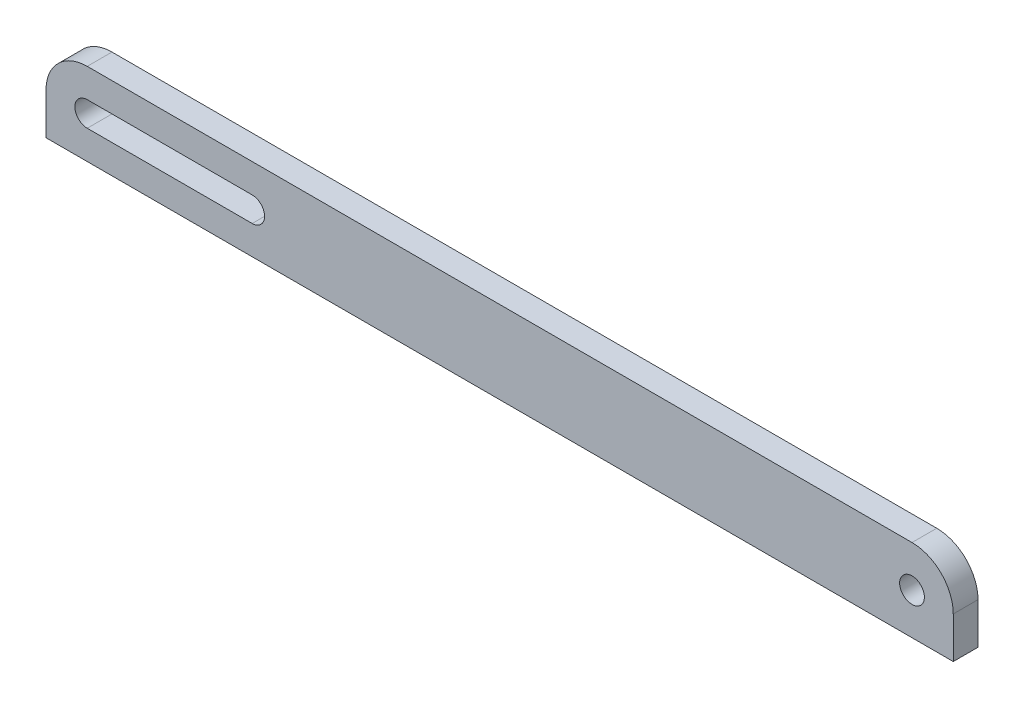
ISO-10303-21;
HEADER;
FILE_DESCRIPTION(('STEP AP214'),'2;1');
FILE_NAME('part.step','',(''),(''),'','','');
FILE_SCHEMA(('AUTOMOTIVE_DESIGN { 1 0 10303 214 1 1 1 1 }'));
ENDSEC;
DATA;
#1=APPLICATION_CONTEXT('core data for automotive mechanical design processes');
#2=APPLICATION_PROTOCOL_DEFINITION('international standard','automotive_design',2000,#1);
#3=PRODUCT_CONTEXT('',#1,'mechanical');
#4=PRODUCT('Part','Part','',(#3));
#5=PRODUCT_RELATED_PRODUCT_CATEGORY('part','',(#4));
#6=PRODUCT_DEFINITION_FORMATION('','',#4);
#7=PRODUCT_DEFINITION_CONTEXT('part definition',#1,'design');
#8=PRODUCT_DEFINITION('design','',#6,#7);
#9=PRODUCT_DEFINITION_SHAPE('','',#8);
#10=(LENGTH_UNIT() NAMED_UNIT(*) SI_UNIT(.MILLI.,.METRE.));
#11=(NAMED_UNIT(*) PLANE_ANGLE_UNIT() SI_UNIT($,.RADIAN.));
#12=(NAMED_UNIT(*) SI_UNIT($,.STERADIAN.) SOLID_ANGLE_UNIT());
#13=UNCERTAINTY_MEASURE_WITH_UNIT(LENGTH_MEASURE(1.E-05),#10,'distance_accuracy_value','');
#14=(GEOMETRIC_REPRESENTATION_CONTEXT(3) GLOBAL_UNCERTAINTY_ASSIGNED_CONTEXT((#13)) GLOBAL_UNIT_ASSIGNED_CONTEXT((#10,
#11,#12)) REPRESENTATION_CONTEXT('',''));
#15=CARTESIAN_POINT('',(0.,0.,0.));
#16=DIRECTION('',(0.,0.,1.));
#17=DIRECTION('',(1.,0.,0.));
#18=AXIS2_PLACEMENT_3D('',#15,#16,#17);
#19=CARTESIAN_POINT('',(-50.,0.,3.));
#20=DIRECTION('',(0.,0.,1.));
#21=DIRECTION('',(1.,0.,0.));
#22=AXIS2_PLACEMENT_3D('',#19,#20,#21);
#23=PLANE('',#22);
#24=CARTESIAN_POINT('',(-50.,0.,3.));
#25=DIRECTION('',(0.,0.,1.));
#26=DIRECTION('',(1.,0.,0.));
#27=AXIS2_PLACEMENT_3D('',#24,#25,#26);
#28=CIRCLE('',#27,5.);
#29=CARTESIAN_POINT('',(-50.,5.,3.));
#30=VERTEX_POINT('',#29);
#31=CARTESIAN_POINT('',(-55.,0.,3.));
#32=VERTEX_POINT('',#31);
#33=EDGE_CURVE('E156',#30,#32,#28,.T.);
#34=ORIENTED_EDGE('',*,*,#33,.T.);
#35=DIRECTION('',(0.,-1.,0.));
#36=VECTOR('',#35,1.);
#37=CARTESIAN_POINT('',(-55.,0.,3.));
#38=LINE('',#37,#36);
#39=CARTESIAN_POINT('',(-55.,-5.,3.));
#40=VERTEX_POINT('',#39);
#41=EDGE_CURVE('E159',#32,#40,#38,.T.);
#42=ORIENTED_EDGE('',*,*,#41,.T.);
#43=DIRECTION('',(1.,0.,0.));
#44=VECTOR('',#43,1.);
#45=CARTESIAN_POINT('',(-55.,-5.,3.));
#46=LINE('',#45,#44);
#47=CARTESIAN_POINT('',(55.,-4.99999999999999,3.));
#48=VERTEX_POINT('',#47);
#49=EDGE_CURVE('E162',#40,#48,#46,.T.);
#50=ORIENTED_EDGE('',*,*,#49,.T.);
#51=DIRECTION('',(0.,1.,0.));
#52=VECTOR('',#51,1.);
#53=CARTESIAN_POINT('',(55.,0.,3.));
#54=LINE('',#53,#52);
#55=CARTESIAN_POINT('',(55.,0.,3.));
#56=VERTEX_POINT('',#55);
#57=EDGE_CURVE('E164',#48,#56,#54,.T.);
#58=ORIENTED_EDGE('',*,*,#57,.T.);
#59=CARTESIAN_POINT('',(50.,0.,3.));
#60=DIRECTION('',(0.,0.,1.));
#61=DIRECTION('',(-1.,0.,0.));
#62=AXIS2_PLACEMENT_3D('',#59,#60,#61);
#63=CIRCLE('',#62,5.);
#64=CARTESIAN_POINT('',(50.,4.99999999999999,3.));
#65=VERTEX_POINT('',#64);
#66=EDGE_CURVE('E166',#56,#65,#63,.T.);
#67=ORIENTED_EDGE('',*,*,#66,.T.);
#68=DIRECTION('',(-1.,0.,0.));
#69=VECTOR('',#68,1.);
#70=CARTESIAN_POINT('',(50.,4.99999999999999,3.));
#71=LINE('',#70,#69);
#72=EDGE_CURVE('E168',#65,#30,#71,.T.);
#73=ORIENTED_EDGE('',*,*,#72,.T.);
#74=EDGE_LOOP('',(#34,#42,#50,#58,#67,#73));
#75=FACE_BOUND('',#74,.T.);
#76=CARTESIAN_POINT('',(50.,0.,3.));
#77=DIRECTION('',(0.,0.,1.));
#78=DIRECTION('',(-1.,0.,0.));
#79=AXIS2_PLACEMENT_3D('',#76,#77,#78);
#80=CIRCLE('',#79,1.5);
#81=CARTESIAN_POINT('',(48.5,0.,3.));
#82=VERTEX_POINT('',#81);
#83=EDGE_CURVE('E150',#82,#82,#80,.T.);
#84=ORIENTED_EDGE('',*,*,#83,.F.);
#85=EDGE_LOOP('',(#84));
#86=FACE_BOUND('',#85,.T.);
#87=DIRECTION('',(1.,0.,0.));
#88=VECTOR('',#87,1.);
#89=CARTESIAN_POINT('',(-50.,-1.5,3.));
#90=LINE('',#89,#88);
#91=CARTESIAN_POINT('',(-50.,-1.5,3.));
#92=VERTEX_POINT('',#91);
#93=CARTESIAN_POINT('',(-30.,-1.5,3.));
#94=VERTEX_POINT('',#93);
#95=EDGE_CURVE('E122',#92,#94,#90,.T.);
#96=ORIENTED_EDGE('',*,*,#95,.F.);
#97=CARTESIAN_POINT('',(-50.,0.,3.));
#98=DIRECTION('',(0.,0.,1.));
#99=DIRECTION('',(1.,0.,0.));
#100=AXIS2_PLACEMENT_3D('',#97,#98,#99);
#101=CIRCLE('',#100,1.5);
#102=CARTESIAN_POINT('',(-50.,1.5,3.));
#103=VERTEX_POINT('',#102);
#104=EDGE_CURVE('E114',#103,#92,#101,.T.);
#105=ORIENTED_EDGE('',*,*,#104,.F.);
#106=DIRECTION('',(-1.,0.,0.));
#107=VECTOR('',#106,1.);
#108=CARTESIAN_POINT('',(-50.,1.5,3.));
#109=LINE('',#108,#107);
#110=CARTESIAN_POINT('',(-30.,1.5,3.));
#111=VERTEX_POINT('',#110);
#112=EDGE_CURVE('E136',#111,#103,#109,.T.);
#113=ORIENTED_EDGE('',*,*,#112,.F.);
#114=CARTESIAN_POINT('',(-30.,0.,3.));
#115=DIRECTION('',(0.,0.,1.));
#116=DIRECTION('',(1.,0.,0.));
#117=AXIS2_PLACEMENT_3D('',#114,#115,#116);
#118=CIRCLE('',#117,1.5);
#119=EDGE_CURVE('E134',#94,#111,#118,.T.);
#120=ORIENTED_EDGE('',*,*,#119,.F.);
#121=EDGE_LOOP('',(#96,#105,#113,#120));
#122=FACE_BOUND('',#121,.T.);
#123=ADVANCED_FACE('F37',(#75,#86,#122),#23,.T.);
#124=CARTESIAN_POINT('',(-50.,0.,0.));
#125=DIRECTION('',(0.,0.,1.));
#126=DIRECTION('',(1.,0.,0.));
#127=AXIS2_PLACEMENT_3D('',#124,#125,#126);
#128=PLANE('',#127);
#129=CARTESIAN_POINT('',(50.,0.,0.));
#130=DIRECTION('',(0.,0.,1.));
#131=DIRECTION('',(-1.,0.,0.));
#132=AXIS2_PLACEMENT_3D('',#129,#130,#131);
#133=CIRCLE('',#132,1.5);
#134=CARTESIAN_POINT('',(48.5,0.,0.));
#135=VERTEX_POINT('',#134);
#136=EDGE_CURVE('E130',#135,#135,#133,.T.);
#137=ORIENTED_EDGE('',*,*,#136,.T.);
#138=EDGE_LOOP('',(#137));
#139=FACE_BOUND('',#138,.T.);
#140=CARTESIAN_POINT('',(-50.,0.,0.));
#141=DIRECTION('',(0.,0.,1.));
#142=DIRECTION('',(1.,0.,0.));
#143=AXIS2_PLACEMENT_3D('',#140,#141,#142);
#144=CIRCLE('',#143,5.);
#145=CARTESIAN_POINT('',(-50.,5.,0.));
#146=VERTEX_POINT('',#145);
#147=CARTESIAN_POINT('',(-55.,0.,0.));
#148=VERTEX_POINT('',#147);
#149=EDGE_CURVE('E153',#146,#148,#144,.T.);
#150=ORIENTED_EDGE('',*,*,#149,.F.);
#151=DIRECTION('',(-1.,0.,0.));
#152=VECTOR('',#151,1.);
#153=CARTESIAN_POINT('',(50.,4.99999999999999,0.));
#154=LINE('',#153,#152);
#155=CARTESIAN_POINT('',(50.,4.99999999999999,0.));
#156=VERTEX_POINT('',#155);
#157=EDGE_CURVE('E160',#156,#146,#154,.T.);
#158=ORIENTED_EDGE('',*,*,#157,.F.);
#159=CARTESIAN_POINT('',(50.,0.,0.));
#160=DIRECTION('',(0.,0.,1.));
#161=DIRECTION('',(-1.,0.,0.));
#162=AXIS2_PLACEMENT_3D('',#159,#160,#161);
#163=CIRCLE('',#162,5.);
#164=CARTESIAN_POINT('',(55.,0.,0.));
#165=VERTEX_POINT('',#164);
#166=EDGE_CURVE('E180',#165,#156,#163,.T.);
#167=ORIENTED_EDGE('',*,*,#166,.F.);
#168=DIRECTION('',(0.,1.,0.));
#169=VECTOR('',#168,1.);
#170=CARTESIAN_POINT('',(55.,0.,0.));
#171=LINE('',#170,#169);
#172=CARTESIAN_POINT('',(55.,-4.99999999999999,0.));
#173=VERTEX_POINT('',#172);
#174=EDGE_CURVE('E178',#173,#165,#171,.T.);
#175=ORIENTED_EDGE('',*,*,#174,.F.);
#176=DIRECTION('',(1.,0.,0.));
#177=VECTOR('',#176,1.);
#178=CARTESIAN_POINT('',(55.,-4.99999999999999,0.));
#179=LINE('',#178,#177);
#180=CARTESIAN_POINT('',(-55.,-5.,0.));
#181=VERTEX_POINT('',#180);
#182=EDGE_CURVE('E176',#181,#173,#179,.T.);
#183=ORIENTED_EDGE('',*,*,#182,.F.);
#184=DIRECTION('',(0.,-1.,0.));
#185=VECTOR('',#184,1.);
#186=CARTESIAN_POINT('',(-55.,0.,0.));
#187=LINE('',#186,#185);
#188=EDGE_CURVE('E173',#148,#181,#187,.T.);
#189=ORIENTED_EDGE('',*,*,#188,.F.);
#190=EDGE_LOOP('',(#150,#158,#167,#175,#183,#189));
#191=FACE_BOUND('',#190,.T.);
#192=CARTESIAN_POINT('',(-50.,0.,0.));
#193=DIRECTION('',(0.,0.,1.));
#194=DIRECTION('',(1.,0.,0.));
#195=AXIS2_PLACEMENT_3D('',#192,#193,#194);
#196=CIRCLE('',#195,1.5);
#197=CARTESIAN_POINT('',(-50.,1.5,0.));
#198=VERTEX_POINT('',#197);
#199=CARTESIAN_POINT('',(-50.,-1.5,0.));
#200=VERTEX_POINT('',#199);
#201=EDGE_CURVE('E60',#198,#200,#196,.T.);
#202=ORIENTED_EDGE('',*,*,#201,.T.);
#203=DIRECTION('',(1.,0.,0.));
#204=VECTOR('',#203,1.);
#205=CARTESIAN_POINT('',(-50.,-1.5,0.));
#206=LINE('',#205,#204);
#207=CARTESIAN_POINT('',(-30.,-1.5,0.));
#208=VERTEX_POINT('',#207);
#209=EDGE_CURVE('E129',#200,#208,#206,.T.);
#210=ORIENTED_EDGE('',*,*,#209,.T.);
#211=CARTESIAN_POINT('',(-30.,0.,0.));
#212=DIRECTION('',(0.,0.,1.));
#213=DIRECTION('',(1.,0.,0.));
#214=AXIS2_PLACEMENT_3D('',#211,#212,#213);
#215=CIRCLE('',#214,1.5);
#216=CARTESIAN_POINT('',(-30.,1.5,0.));
#217=VERTEX_POINT('',#216);
#218=EDGE_CURVE('E142',#208,#217,#215,.T.);
#219=ORIENTED_EDGE('',*,*,#218,.T.);
#220=DIRECTION('',(-1.,0.,0.));
#221=VECTOR('',#220,1.);
#222=CARTESIAN_POINT('',(-50.,1.5,0.));
#223=LINE('',#222,#221);
#224=EDGE_CURVE('E123',#217,#198,#223,.T.);
#225=ORIENTED_EDGE('',*,*,#224,.T.);
#226=EDGE_LOOP('',(#202,#210,#219,#225));
#227=FACE_BOUND('',#226,.T.);
#228=ADVANCED_FACE('F204',(#139,#191,#227),#128,.F.);
#229=CARTESIAN_POINT('',(-50.,0.,3.));
#230=DIRECTION('',(0.,0.,-1.));
#231=DIRECTION('',(-1.,0.,0.));
#232=AXIS2_PLACEMENT_3D('',#229,#230,#231);
#233=CYLINDRICAL_SURFACE('',#232,5.);
#234=ORIENTED_EDGE('',*,*,#149,.T.);
#235=DIRECTION('',(0.,0.,-1.));
#236=VECTOR('',#235,1.);
#237=CARTESIAN_POINT('',(-55.,0.,3.));
#238=LINE('',#237,#236);
#239=EDGE_CURVE('E11',#32,#148,#238,.T.);
#240=ORIENTED_EDGE('',*,*,#239,.F.);
#241=ORIENTED_EDGE('',*,*,#33,.F.);
#242=DIRECTION('',(0.,0.,-1.));
#243=VECTOR('',#242,1.);
#244=CARTESIAN_POINT('',(-50.,5.,3.));
#245=LINE('',#244,#243);
#246=EDGE_CURVE('E170',#30,#146,#245,.T.);
#247=ORIENTED_EDGE('',*,*,#246,.T.);
#248=EDGE_LOOP('',(#234,#240,#241,#247));
#249=FACE_BOUND('',#248,.T.);
#250=ADVANCED_FACE('F39',(#249),#233,.T.);
#251=CARTESIAN_POINT('',(-55.,0.,3.));
#252=DIRECTION('',(1.,0.,0.));
#253=DIRECTION('',(0.,1.,0.));
#254=AXIS2_PLACEMENT_3D('',#251,#252,#253);
#255=PLANE('',#254);
#256=ORIENTED_EDGE('',*,*,#188,.T.);
#257=DIRECTION('',(0.,0.,-1.));
#258=VECTOR('',#257,1.);
#259=CARTESIAN_POINT('',(-55.,-5.,3.));
#260=LINE('',#259,#258);
#261=EDGE_CURVE('E45',#40,#181,#260,.T.);
#262=ORIENTED_EDGE('',*,*,#261,.F.);
#263=ORIENTED_EDGE('',*,*,#41,.F.);
#264=ORIENTED_EDGE('',*,*,#239,.T.);
#265=EDGE_LOOP('',(#256,#262,#263,#264));
#266=FACE_BOUND('',#265,.T.);
#267=ADVANCED_FACE('F200',(#266),#255,.F.);
#268=CARTESIAN_POINT('',(55.,-4.99999999999999,3.));
#269=DIRECTION('',(0.,1.,0.));
#270=DIRECTION('',(-1.,0.,0.));
#271=AXIS2_PLACEMENT_3D('',#268,#269,#270);
#272=PLANE('',#271);
#273=ORIENTED_EDGE('',*,*,#182,.T.);
#274=DIRECTION('',(0.,0.,-1.));
#275=VECTOR('',#274,1.);
#276=CARTESIAN_POINT('',(55.,-4.99999999999999,3.));
#277=LINE('',#276,#275);
#278=EDGE_CURVE('E191',#48,#173,#277,.T.);
#279=ORIENTED_EDGE('',*,*,#278,.F.);
#280=ORIENTED_EDGE('',*,*,#49,.F.);
#281=ORIENTED_EDGE('',*,*,#261,.T.);
#282=EDGE_LOOP('',(#273,#279,#280,#281));
#283=FACE_BOUND('',#282,.T.);
#284=ADVANCED_FACE('F197',(#283),#272,.F.);
#285=CARTESIAN_POINT('',(55.,0.,3.));
#286=DIRECTION('',(-1.,0.,0.));
#287=DIRECTION('',(0.,-1.,0.));
#288=AXIS2_PLACEMENT_3D('',#285,#286,#287);
#289=PLANE('',#288);
#290=ORIENTED_EDGE('',*,*,#174,.T.);
#291=DIRECTION('',(0.,0.,-1.));
#292=VECTOR('',#291,1.);
#293=CARTESIAN_POINT('',(55.,0.,3.));
#294=LINE('',#293,#292);
#295=EDGE_CURVE('E188',#56,#165,#294,.T.);
#296=ORIENTED_EDGE('',*,*,#295,.F.);
#297=ORIENTED_EDGE('',*,*,#57,.F.);
#298=ORIENTED_EDGE('',*,*,#278,.T.);
#299=EDGE_LOOP('',(#290,#296,#297,#298));
#300=FACE_BOUND('',#299,.T.);
#301=ADVANCED_FACE('F211',(#300),#289,.F.);
#302=CARTESIAN_POINT('',(50.,0.,3.));
#303=DIRECTION('',(0.,0.,-1.));
#304=DIRECTION('',(-1.,0.,0.));
#305=AXIS2_PLACEMENT_3D('',#302,#303,#304);
#306=CYLINDRICAL_SURFACE('',#305,5.);
#307=ORIENTED_EDGE('',*,*,#166,.T.);
#308=DIRECTION('',(0.,0.,-1.));
#309=VECTOR('',#308,1.);
#310=CARTESIAN_POINT('',(50.,4.99999999999999,3.));
#311=LINE('',#310,#309);
#312=EDGE_CURVE('E185',#65,#156,#311,.T.);
#313=ORIENTED_EDGE('',*,*,#312,.F.);
#314=ORIENTED_EDGE('',*,*,#66,.F.);
#315=ORIENTED_EDGE('',*,*,#295,.T.);
#316=EDGE_LOOP('',(#307,#313,#314,#315));
#317=FACE_BOUND('',#316,.T.);
#318=ADVANCED_FACE('F215',(#317),#306,.T.);
#319=CARTESIAN_POINT('',(50.,4.99999999999999,3.));
#320=DIRECTION('',(0.,-1.,0.));
#321=DIRECTION('',(1.,0.,0.));
#322=AXIS2_PLACEMENT_3D('',#319,#320,#321);
#323=PLANE('',#322);
#324=ORIENTED_EDGE('',*,*,#157,.T.);
#325=ORIENTED_EDGE('',*,*,#246,.F.);
#326=ORIENTED_EDGE('',*,*,#72,.F.);
#327=ORIENTED_EDGE('',*,*,#312,.T.);
#328=EDGE_LOOP('',(#324,#325,#326,#327));
#329=FACE_BOUND('',#328,.T.);
#330=ADVANCED_FACE('F224',(#329),#323,.F.);
#331=CARTESIAN_POINT('',(50.,0.,3.));
#332=DIRECTION('',(0.,0.,-1.));
#333=DIRECTION('',(-1.,0.,0.));
#334=AXIS2_PLACEMENT_3D('',#331,#332,#333);
#335=CYLINDRICAL_SURFACE('',#334,1.5);
#336=ORIENTED_EDGE('',*,*,#83,.T.);
#337=EDGE_LOOP('',(#336));
#338=FACE_BOUND('',#337,.T.);
#339=ORIENTED_EDGE('',*,*,#136,.F.);
#340=EDGE_LOOP('',(#339));
#341=FACE_BOUND('',#340,.T.);
#342=ADVANCED_FACE('F226',(#338,#341),#335,.F.);
#343=CARTESIAN_POINT('',(-50.,0.,3.));
#344=DIRECTION('',(0.,0.,-1.));
#345=DIRECTION('',(-1.,0.,0.));
#346=AXIS2_PLACEMENT_3D('',#343,#344,#345);
#347=CYLINDRICAL_SURFACE('',#346,1.5);
#348=ORIENTED_EDGE('',*,*,#201,.F.);
#349=DIRECTION('',(0.,0.,-1.));
#350=VECTOR('',#349,1.);
#351=CARTESIAN_POINT('',(-50.,1.5,3.));
#352=LINE('',#351,#350);
#353=EDGE_CURVE('E118',#103,#198,#352,.T.);
#354=ORIENTED_EDGE('',*,*,#353,.F.);
#355=ORIENTED_EDGE('',*,*,#104,.T.);
#356=DIRECTION('',(0.,0.,-1.));
#357=VECTOR('',#356,1.);
#358=CARTESIAN_POINT('',(-50.,-1.5,3.));
#359=LINE('',#358,#357);
#360=EDGE_CURVE('E117',#92,#200,#359,.T.);
#361=ORIENTED_EDGE('',*,*,#360,.T.);
#362=EDGE_LOOP('',(#348,#354,#355,#361));
#363=FACE_BOUND('',#362,.T.);
#364=ADVANCED_FACE('F116',(#363),#347,.F.);
#365=CARTESIAN_POINT('',(-50.,-1.5,3.));
#366=DIRECTION('',(0.,1.,0.));
#367=DIRECTION('',(0.,0.,1.));
#368=AXIS2_PLACEMENT_3D('',#365,#366,#367);
#369=PLANE('',#368);
#370=ORIENTED_EDGE('',*,*,#209,.F.);
#371=ORIENTED_EDGE('',*,*,#360,.F.);
#372=ORIENTED_EDGE('',*,*,#95,.T.);
#373=DIRECTION('',(0.,0.,-1.));
#374=VECTOR('',#373,1.);
#375=CARTESIAN_POINT('',(-30.,-1.5,3.));
#376=LINE('',#375,#374);
#377=EDGE_CURVE('E131',#94,#208,#376,.T.);
#378=ORIENTED_EDGE('',*,*,#377,.T.);
#379=EDGE_LOOP('',(#370,#371,#372,#378));
#380=FACE_BOUND('',#379,.T.);
#381=ADVANCED_FACE('F126',(#380),#369,.T.);
#382=CARTESIAN_POINT('',(-30.,0.,3.));
#383=DIRECTION('',(0.,0.,-1.));
#384=DIRECTION('',(-1.,0.,0.));
#385=AXIS2_PLACEMENT_3D('',#382,#383,#384);
#386=CYLINDRICAL_SURFACE('',#385,1.5);
#387=ORIENTED_EDGE('',*,*,#218,.F.);
#388=ORIENTED_EDGE('',*,*,#377,.F.);
#389=ORIENTED_EDGE('',*,*,#119,.T.);
#390=DIRECTION('',(0.,0.,-1.));
#391=VECTOR('',#390,1.);
#392=CARTESIAN_POINT('',(-30.,1.5,3.));
#393=LINE('',#392,#391);
#394=EDGE_CURVE('E52',#111,#217,#393,.T.);
#395=ORIENTED_EDGE('',*,*,#394,.T.);
#396=EDGE_LOOP('',(#387,#388,#389,#395));
#397=FACE_BOUND('',#396,.T.);
#398=ADVANCED_FACE('F247',(#397),#386,.F.);
#399=CARTESIAN_POINT('',(-50.,1.5,3.));
#400=DIRECTION('',(0.,-1.,0.));
#401=DIRECTION('',(0.,0.,-1.));
#402=AXIS2_PLACEMENT_3D('',#399,#400,#401);
#403=PLANE('',#402);
#404=ORIENTED_EDGE('',*,*,#224,.F.);
#405=ORIENTED_EDGE('',*,*,#394,.F.);
#406=ORIENTED_EDGE('',*,*,#112,.T.);
#407=ORIENTED_EDGE('',*,*,#353,.T.);
#408=EDGE_LOOP('',(#404,#405,#406,#407));
#409=FACE_BOUND('',#408,.T.);
#410=ADVANCED_FACE('F250',(#409),#403,.T.);
#411=CLOSED_SHELL('',(#123,#228,#250,#267,#284,#301,#318,#330,#342,#364,#381,#398,#410));
#412=MANIFOLD_SOLID_BREP('B2',#411);
#413=ADVANCED_BREP_SHAPE_REPRESENTATION('',(#18,#412),#14);
#414=SHAPE_DEFINITION_REPRESENTATION(#9,#413);
ENDSEC;
END-ISO-10303-21;
